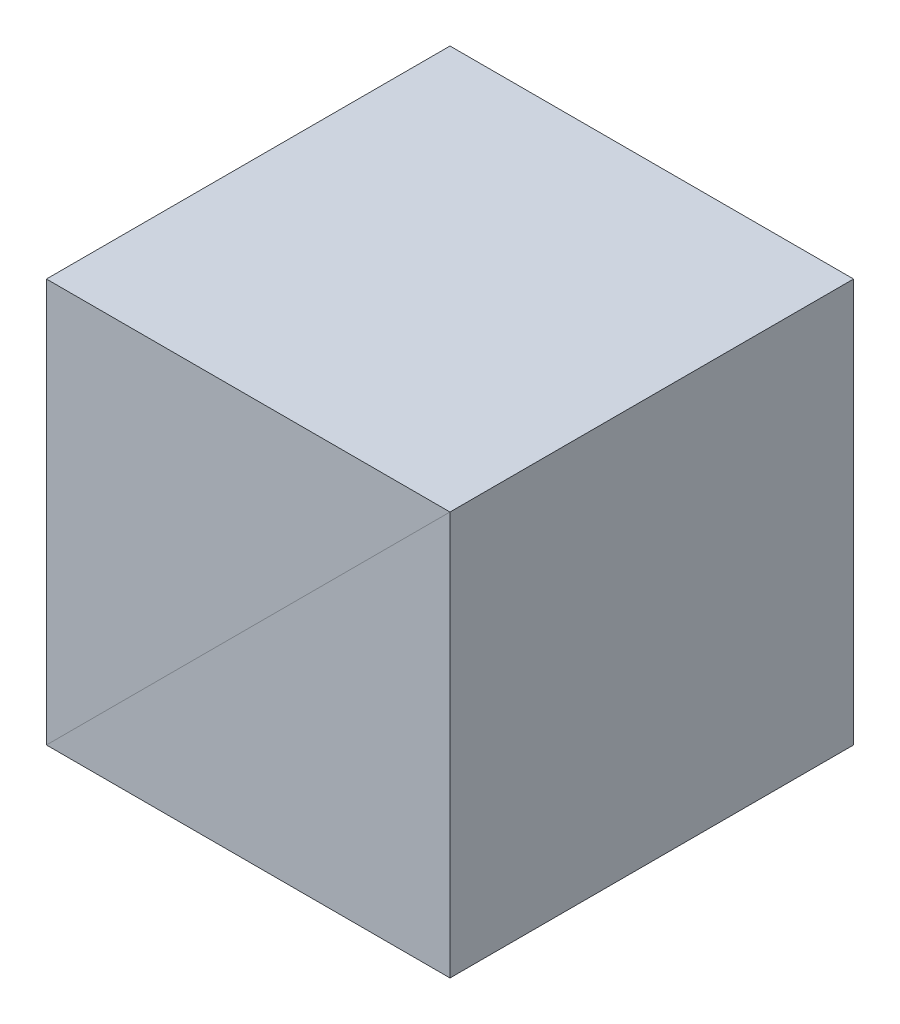
ISO-10303-21;
HEADER;
FILE_DESCRIPTION(('STEP AP214'),'2;1');
FILE_NAME('part.step','',(''),(''),'','','');
FILE_SCHEMA(('AUTOMOTIVE_DESIGN { 1 0 10303 214 1 1 1 1 }'));
ENDSEC;
DATA;
#1=APPLICATION_CONTEXT('core data for automotive mechanical design processes');
#2=APPLICATION_PROTOCOL_DEFINITION('international standard','automotive_design',2000,#1);
#3=PRODUCT_CONTEXT('',#1,'mechanical');
#4=PRODUCT('Part','Part','',(#3));
#5=PRODUCT_RELATED_PRODUCT_CATEGORY('part','',(#4));
#6=PRODUCT_DEFINITION_FORMATION('','',#4);
#7=PRODUCT_DEFINITION_CONTEXT('part definition',#1,'design');
#8=PRODUCT_DEFINITION('design','',#6,#7);
#9=PRODUCT_DEFINITION_SHAPE('','',#8);
#10=(LENGTH_UNIT() NAMED_UNIT(*) SI_UNIT(.MILLI.,.METRE.));
#11=(NAMED_UNIT(*) PLANE_ANGLE_UNIT() SI_UNIT($,.RADIAN.));
#12=(NAMED_UNIT(*) SI_UNIT($,.STERADIAN.) SOLID_ANGLE_UNIT());
#13=UNCERTAINTY_MEASURE_WITH_UNIT(LENGTH_MEASURE(1.E-05),#10,'distance_accuracy_value','');
#14=(GEOMETRIC_REPRESENTATION_CONTEXT(3) GLOBAL_UNCERTAINTY_ASSIGNED_CONTEXT((#13)) GLOBAL_UNIT_ASSIGNED_CONTEXT((#10,
#11,#12)) REPRESENTATION_CONTEXT('',''));
#15=CARTESIAN_POINT('',(0.,0.,0.));
#16=DIRECTION('',(0.,0.,1.));
#17=DIRECTION('',(1.,0.,0.));
#18=AXIS2_PLACEMENT_3D('',#15,#16,#17);
#19=CARTESIAN_POINT('',(10.,10.,10.));
#20=DIRECTION('',(-0.707106781186547,0.707106781186548,0.));
#21=DIRECTION('',(0.707106781186548,0.707106781186547,0.));
#22=AXIS2_PLACEMENT_3D('',#19,#20,#21);
#23=PLANE('',#22);
#24=DIRECTION('',(-0.707106781186548,-0.707106781186547,0.));
#25=VECTOR('',#24,1.);
#26=CARTESIAN_POINT('',(10.,10.,-10.));
#27=LINE('',#26,#25);
#28=CARTESIAN_POINT('',(10.,10.,-10.));
#29=VERTEX_POINT('',#28);
#30=CARTESIAN_POINT('',(-10.,-10.,-10.));
#31=VERTEX_POINT('',#30);
#32=EDGE_CURVE('E106',#29,#31,#27,.T.);
#33=ORIENTED_EDGE('',*,*,#32,.F.);
#34=DIRECTION('',(0.,0.,-1.));
#35=VECTOR('',#34,1.);
#36=CARTESIAN_POINT('',(10.,10.,10.));
#37=LINE('',#36,#35);
#38=CARTESIAN_POINT('',(10.,10.,10.));
#39=VERTEX_POINT('',#38);
#40=EDGE_CURVE('E98',#39,#29,#37,.T.);
#41=ORIENTED_EDGE('',*,*,#40,.F.);
#42=DIRECTION('',(-0.707106781186548,-0.707106781186547,0.));
#43=VECTOR('',#42,1.);
#44=CARTESIAN_POINT('',(10.,10.,10.));
#45=LINE('',#44,#43);
#46=CARTESIAN_POINT('',(-10.,-10.,10.));
#47=VERTEX_POINT('',#46);
#48=EDGE_CURVE('E89',#39,#47,#45,.T.);
#49=ORIENTED_EDGE('',*,*,#48,.T.);
#50=DIRECTION('',(0.,0.,-1.));
#51=VECTOR('',#50,1.);
#52=CARTESIAN_POINT('',(-10.,-10.,10.));
#53=LINE('',#52,#51);
#54=EDGE_CURVE('E12',#47,#31,#53,.T.);
#55=ORIENTED_EDGE('',*,*,#54,.T.);
#56=EDGE_LOOP('',(#33,#41,#49,#55));
#57=FACE_BOUND('',#56,.T.);
#58=ADVANCED_FACE('F49',(#57),#23,.F.);
#59=CARTESIAN_POINT('',(-10.,-10.,10.));
#60=DIRECTION('',(1.,0.,0.));
#61=DIRECTION('',(0.,0.,1.));
#62=AXIS2_PLACEMENT_3D('',#59,#60,#61);
#63=PLANE('',#62);
#64=DIRECTION('',(0.,1.,0.));
#65=VECTOR('',#64,1.);
#66=CARTESIAN_POINT('',(-10.,-10.,-10.));
#67=LINE('',#66,#65);
#68=CARTESIAN_POINT('',(-10.,10.,-10.));
#69=VERTEX_POINT('',#68);
#70=EDGE_CURVE('E95',#31,#69,#67,.T.);
#71=ORIENTED_EDGE('',*,*,#70,.F.);
#72=ORIENTED_EDGE('',*,*,#54,.F.);
#73=DIRECTION('',(0.,1.,0.));
#74=VECTOR('',#73,1.);
#75=CARTESIAN_POINT('',(-10.,-10.,10.));
#76=LINE('',#75,#74);
#77=CARTESIAN_POINT('',(-10.,10.,10.));
#78=VERTEX_POINT('',#77);
#79=EDGE_CURVE('E85',#47,#78,#76,.T.);
#80=ORIENTED_EDGE('',*,*,#79,.T.);
#81=DIRECTION('',(0.,0.,-1.));
#82=VECTOR('',#81,1.);
#83=CARTESIAN_POINT('',(-10.,10.,10.));
#84=LINE('',#83,#82);
#85=EDGE_CURVE('E58',#78,#69,#84,.T.);
#86=ORIENTED_EDGE('',*,*,#85,.T.);
#87=EDGE_LOOP('',(#71,#72,#80,#86));
#88=FACE_BOUND('',#87,.T.);
#89=ADVANCED_FACE('F94',(#88),#63,.F.);
#90=CARTESIAN_POINT('',(10.,10.,10.));
#91=DIRECTION('',(0.,-1.,0.));
#92=DIRECTION('',(0.,0.,1.));
#93=AXIS2_PLACEMENT_3D('',#90,#91,#92);
#94=PLANE('',#93);
#95=DIRECTION('',(1.,0.,0.));
#96=VECTOR('',#95,1.);
#97=CARTESIAN_POINT('',(10.,10.,-10.));
#98=LINE('',#97,#96);
#99=EDGE_CURVE('E77',#69,#29,#98,.T.);
#100=ORIENTED_EDGE('',*,*,#99,.F.);
#101=ORIENTED_EDGE('',*,*,#85,.F.);
#102=DIRECTION('',(1.,0.,0.));
#103=VECTOR('',#102,1.);
#104=CARTESIAN_POINT('',(10.,10.,10.));
#105=LINE('',#104,#103);
#106=EDGE_CURVE('E66',#78,#39,#105,.T.);
#107=ORIENTED_EDGE('',*,*,#106,.T.);
#108=ORIENTED_EDGE('',*,*,#40,.T.);
#109=EDGE_LOOP('',(#100,#101,#107,#108));
#110=FACE_BOUND('',#109,.T.);
#111=ADVANCED_FACE('F119',(#110),#94,.F.);
#112=CARTESIAN_POINT('',(0.,0.,10.));
#113=DIRECTION('',(0.,0.,1.));
#114=DIRECTION('',(0.,1.,0.));
#115=AXIS2_PLACEMENT_3D('',#112,#113,#114);
#116=PLANE('',#115);
#117=ORIENTED_EDGE('',*,*,#48,.F.);
#118=ORIENTED_EDGE('',*,*,#106,.F.);
#119=ORIENTED_EDGE('',*,*,#79,.F.);
#120=EDGE_LOOP('',(#117,#118,#119));
#121=FACE_BOUND('',#120,.T.);
#122=ADVANCED_FACE('F87',(#121),#116,.T.);
#123=CARTESIAN_POINT('',(0.,0.,-10.));
#124=DIRECTION('',(0.,0.,1.));
#125=DIRECTION('',(0.,1.,0.));
#126=AXIS2_PLACEMENT_3D('',#123,#124,#125);
#127=PLANE('',#126);
#128=ORIENTED_EDGE('',*,*,#32,.T.);
#129=ORIENTED_EDGE('',*,*,#70,.T.);
#130=ORIENTED_EDGE('',*,*,#99,.T.);
#131=EDGE_LOOP('',(#128,#129,#130));
#132=FACE_BOUND('',#131,.T.);
#133=ADVANCED_FACE('F113',(#132),#127,.F.);
#134=CLOSED_SHELL('',(#58,#89,#111,#122,#133));
#135=MANIFOLD_SOLID_BREP('B2',#134);
#136=CARTESIAN_POINT('',(10.,10.,10.));
#137=DIRECTION('',(0.707106781186547,-0.707106781186548,0.));
#138=DIRECTION('',(0.707106781186548,0.707106781186547,0.));
#139=AXIS2_PLACEMENT_3D('',#136,#137,#138);
#140=PLANE('',#139);
#141=DIRECTION('',(-0.707106781186548,-0.707106781186547,0.));
#142=VECTOR('',#141,1.);
#143=CARTESIAN_POINT('',(10.,10.,-10.));
#144=LINE('',#143,#142);
#145=CARTESIAN_POINT('',(10.,10.,-10.));
#146=VERTEX_POINT('',#145);
#147=CARTESIAN_POINT('',(-10.,-10.,-10.));
#148=VERTEX_POINT('',#147);
#149=EDGE_CURVE('E203',#146,#148,#144,.T.);
#150=ORIENTED_EDGE('',*,*,#149,.T.);
#151=DIRECTION('',(0.,0.,-1.));
#152=VECTOR('',#151,1.);
#153=CARTESIAN_POINT('',(-10.,-10.,10.));
#154=LINE('',#153,#152);
#155=CARTESIAN_POINT('',(-10.,-10.,10.));
#156=VERTEX_POINT('',#155);
#157=EDGE_CURVE('E47',#156,#148,#154,.T.);
#158=ORIENTED_EDGE('',*,*,#157,.F.);
#159=DIRECTION('',(-0.707106781186548,-0.707106781186547,0.));
#160=VECTOR('',#159,1.);
#161=CARTESIAN_POINT('',(10.,10.,10.));
#162=LINE('',#161,#160);
#163=CARTESIAN_POINT('',(10.,10.,10.));
#164=VERTEX_POINT('',#163);
#165=EDGE_CURVE('E196',#164,#156,#162,.T.);
#166=ORIENTED_EDGE('',*,*,#165,.F.);
#167=DIRECTION('',(0.,0.,-1.));
#168=VECTOR('',#167,1.);
#169=CARTESIAN_POINT('',(10.,10.,10.));
#170=LINE('',#169,#168);
#171=EDGE_CURVE('E204',#164,#146,#170,.T.);
#172=ORIENTED_EDGE('',*,*,#171,.T.);
#173=EDGE_LOOP('',(#150,#158,#166,#172));
#174=FACE_BOUND('',#173,.T.);
#175=ADVANCED_FACE('F156',(#174),#140,.F.);
#176=CARTESIAN_POINT('',(-10.,-10.,10.));
#177=DIRECTION('',(0.,1.,0.));
#178=DIRECTION('',(0.,0.,1.));
#179=AXIS2_PLACEMENT_3D('',#176,#177,#178);
#180=PLANE('',#179);
#181=DIRECTION('',(1.,0.,0.));
#182=VECTOR('',#181,1.);
#183=CARTESIAN_POINT('',(-10.,-10.,-10.));
#184=LINE('',#183,#182);
#185=CARTESIAN_POINT('',(10.,-10.,-10.));
#186=VERTEX_POINT('',#185);
#187=EDGE_CURVE('E184',#148,#186,#184,.T.);
#188=ORIENTED_EDGE('',*,*,#187,.T.);
#189=DIRECTION('',(0.,0.,-1.));
#190=VECTOR('',#189,1.);
#191=CARTESIAN_POINT('',(10.,-10.,10.));
#192=LINE('',#191,#190);
#193=CARTESIAN_POINT('',(10.,-10.,10.));
#194=VERTEX_POINT('',#193);
#195=EDGE_CURVE('E164',#194,#186,#192,.T.);
#196=ORIENTED_EDGE('',*,*,#195,.F.);
#197=DIRECTION('',(1.,0.,0.));
#198=VECTOR('',#197,1.);
#199=CARTESIAN_POINT('',(-10.,-10.,10.));
#200=LINE('',#199,#198);
#201=EDGE_CURVE('E192',#156,#194,#200,.T.);
#202=ORIENTED_EDGE('',*,*,#201,.F.);
#203=ORIENTED_EDGE('',*,*,#157,.T.);
#204=EDGE_LOOP('',(#188,#196,#202,#203));
#205=FACE_BOUND('',#204,.T.);
#206=ADVANCED_FACE('F193',(#205),#180,.F.);
#207=CARTESIAN_POINT('',(10.,10.,10.));
#208=DIRECTION('',(-1.,0.,0.));
#209=DIRECTION('',(0.,0.,1.));
#210=AXIS2_PLACEMENT_3D('',#207,#208,#209);
#211=PLANE('',#210);
#212=DIRECTION('',(0.,1.,0.));
#213=VECTOR('',#212,1.);
#214=CARTESIAN_POINT('',(10.,10.,-10.));
#215=LINE('',#214,#213);
#216=EDGE_CURVE('E189',#186,#146,#215,.T.);
#217=ORIENTED_EDGE('',*,*,#216,.T.);
#218=ORIENTED_EDGE('',*,*,#171,.F.);
#219=DIRECTION('',(0.,1.,0.));
#220=VECTOR('',#219,1.);
#221=CARTESIAN_POINT('',(10.,10.,10.));
#222=LINE('',#221,#220);
#223=EDGE_CURVE('E172',#194,#164,#222,.T.);
#224=ORIENTED_EDGE('',*,*,#223,.F.);
#225=ORIENTED_EDGE('',*,*,#195,.T.);
#226=EDGE_LOOP('',(#217,#218,#224,#225));
#227=FACE_BOUND('',#226,.T.);
#228=ADVANCED_FACE('F211',(#227),#211,.F.);
#229=CARTESIAN_POINT('',(0.,0.,10.));
#230=DIRECTION('',(0.,0.,1.));
#231=DIRECTION('',(1.,0.,0.));
#232=AXIS2_PLACEMENT_3D('',#229,#230,#231);
#233=PLANE('',#232);
#234=ORIENTED_EDGE('',*,*,#165,.T.);
#235=ORIENTED_EDGE('',*,*,#201,.T.);
#236=ORIENTED_EDGE('',*,*,#223,.T.);
#237=EDGE_LOOP('',(#234,#235,#236));
#238=FACE_BOUND('',#237,.T.);
#239=ADVANCED_FACE('F199',(#238),#233,.T.);
#240=CARTESIAN_POINT('',(0.,0.,-10.));
#241=DIRECTION('',(0.,0.,1.));
#242=DIRECTION('',(1.,0.,0.));
#243=AXIS2_PLACEMENT_3D('',#240,#241,#242);
#244=PLANE('',#243);
#245=ORIENTED_EDGE('',*,*,#149,.F.);
#246=ORIENTED_EDGE('',*,*,#216,.F.);
#247=ORIENTED_EDGE('',*,*,#187,.F.);
#248=EDGE_LOOP('',(#245,#246,#247));
#249=FACE_BOUND('',#248,.T.);
#250=ADVANCED_FACE('F212',(#249),#244,.F.);
#251=CLOSED_SHELL('',(#175,#206,#228,#239,#250));
#252=MANIFOLD_SOLID_BREP('B6',#251);
#253=ADVANCED_BREP_SHAPE_REPRESENTATION('',(#18,#135,#252),#14);
#254=SHAPE_DEFINITION_REPRESENTATION(#9,#253);
ENDSEC;
END-ISO-10303-21;
